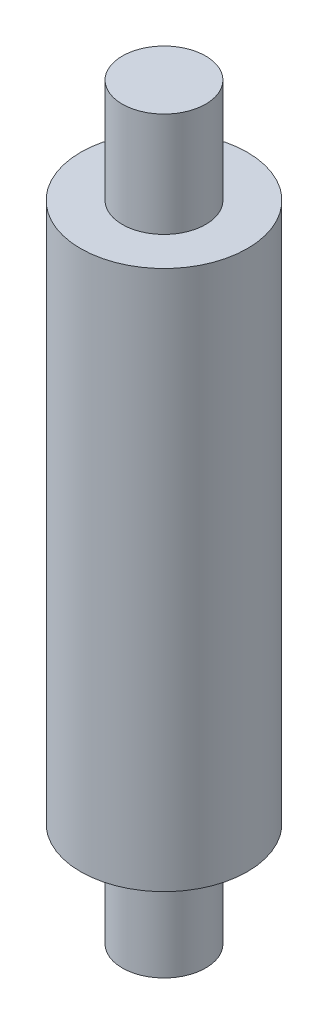
ISO-10303-21;
HEADER;
FILE_DESCRIPTION(('STEP AP214'),'2;1');
FILE_NAME('part.step','',(''),(''),'','','');
FILE_SCHEMA(('AUTOMOTIVE_DESIGN { 1 0 10303 214 1 1 1 1 }'));
ENDSEC;
DATA;
#1=APPLICATION_CONTEXT('core data for automotive mechanical design processes');
#2=APPLICATION_PROTOCOL_DEFINITION('international standard','automotive_design',2000,#1);
#3=PRODUCT_CONTEXT('',#1,'mechanical');
#4=PRODUCT('Part','Part','',(#3));
#5=PRODUCT_RELATED_PRODUCT_CATEGORY('part','',(#4));
#6=PRODUCT_DEFINITION_FORMATION('','',#4);
#7=PRODUCT_DEFINITION_CONTEXT('part definition',#1,'design');
#8=PRODUCT_DEFINITION('design','',#6,#7);
#9=PRODUCT_DEFINITION_SHAPE('','',#8);
#10=(LENGTH_UNIT() NAMED_UNIT(*) SI_UNIT(.MILLI.,.METRE.));
#11=(NAMED_UNIT(*) PLANE_ANGLE_UNIT() SI_UNIT($,.RADIAN.));
#12=(NAMED_UNIT(*) SI_UNIT($,.STERADIAN.) SOLID_ANGLE_UNIT());
#13=UNCERTAINTY_MEASURE_WITH_UNIT(LENGTH_MEASURE(1.E-05),#10,'distance_accuracy_value','');
#14=(GEOMETRIC_REPRESENTATION_CONTEXT(3) GLOBAL_UNCERTAINTY_ASSIGNED_CONTEXT((#13)) GLOBAL_UNIT_ASSIGNED_CONTEXT((#10,
#11,#12)) REPRESENTATION_CONTEXT('',''));
#15=CARTESIAN_POINT('',(0.,0.,0.));
#16=DIRECTION('',(0.,0.,1.));
#17=DIRECTION('',(1.,0.,0.));
#18=AXIS2_PLACEMENT_3D('',#15,#16,#17);
#19=CARTESIAN_POINT('',(0.,0.,0.));
#20=DIRECTION('',(0.,1.,0.));
#21=DIRECTION('',(0.,0.,1.));
#22=AXIS2_PLACEMENT_3D('',#19,#20,#21);
#23=CYLINDRICAL_SURFACE('',#22,3.4544);
#24=CARTESIAN_POINT('',(0.,4.318,0.));
#25=DIRECTION('',(0.,1.,0.));
#26=DIRECTION('',(0.,0.,1.));
#27=AXIS2_PLACEMENT_3D('',#24,#25,#26);
#28=CIRCLE('',#27,3.4544);
#29=CARTESIAN_POINT('',(0.,4.318,3.4544));
#30=VERTEX_POINT('',#29);
#31=EDGE_CURVE('E39',#30,#30,#28,.T.);
#32=ORIENTED_EDGE('',*,*,#31,.T.);
#33=EDGE_LOOP('',(#32));
#34=FACE_BOUND('',#33,.T.);
#35=CARTESIAN_POINT('',(0.,26.67,0.));
#36=DIRECTION('',(0.,1.,0.));
#37=DIRECTION('',(0.,0.,1.));
#38=AXIS2_PLACEMENT_3D('',#35,#36,#37);
#39=CIRCLE('',#38,3.4544);
#40=CARTESIAN_POINT('',(0.,26.67,3.4544));
#41=VERTEX_POINT('',#40);
#42=EDGE_CURVE('E55',#41,#41,#39,.T.);
#43=ORIENTED_EDGE('',*,*,#42,.F.);
#44=EDGE_LOOP('',(#43));
#45=FACE_BOUND('',#44,.T.);
#46=ADVANCED_FACE('F32',(#34,#45),#23,.T.);
#47=CARTESIAN_POINT('',(0.,0.,0.));
#48=DIRECTION('',(0.,1.,0.));
#49=DIRECTION('',(0.,0.,1.));
#50=AXIS2_PLACEMENT_3D('',#47,#48,#49);
#51=CYLINDRICAL_SURFACE('',#50,1.7272);
#52=CARTESIAN_POINT('',(0.,0.,0.));
#53=DIRECTION('',(0.,1.,0.));
#54=DIRECTION('',(0.,0.,1.));
#55=AXIS2_PLACEMENT_3D('',#52,#53,#54);
#56=CIRCLE('',#55,1.7272);
#57=CARTESIAN_POINT('',(0.,0.,1.7272));
#58=VERTEX_POINT('',#57);
#59=EDGE_CURVE('E10',#58,#58,#56,.T.);
#60=ORIENTED_EDGE('',*,*,#59,.T.);
#61=EDGE_LOOP('',(#60));
#62=FACE_BOUND('',#61,.T.);
#63=CARTESIAN_POINT('',(0.,4.318,0.));
#64=DIRECTION('',(0.,1.,0.));
#65=DIRECTION('',(0.,0.,1.));
#66=AXIS2_PLACEMENT_3D('',#63,#64,#65);
#67=CIRCLE('',#66,1.7272);
#68=CARTESIAN_POINT('',(0.,4.318,1.7272));
#69=VERTEX_POINT('',#68);
#70=EDGE_CURVE('E43',#69,#69,#67,.T.);
#71=ORIENTED_EDGE('',*,*,#70,.F.);
#72=EDGE_LOOP('',(#71));
#73=FACE_BOUND('',#72,.T.);
#74=ADVANCED_FACE('F63',(#62,#73),#51,.T.);
#75=CARTESIAN_POINT('',(3.4544,4.318,0.));
#76=DIRECTION('',(0.,-1.,0.));
#77=DIRECTION('',(0.,0.,-1.));
#78=AXIS2_PLACEMENT_3D('',#75,#76,#77);
#79=PLANE('',#78);
#80=ORIENTED_EDGE('',*,*,#70,.T.);
#81=EDGE_LOOP('',(#80));
#82=FACE_BOUND('',#81,.T.);
#83=ORIENTED_EDGE('',*,*,#31,.F.);
#84=EDGE_LOOP('',(#83));
#85=FACE_BOUND('',#84,.T.);
#86=ADVANCED_FACE('F67',(#82,#85),#79,.T.);
#87=CARTESIAN_POINT('',(3.4544,0.,0.));
#88=DIRECTION('',(0.,1.,0.));
#89=DIRECTION('',(0.,0.,1.));
#90=AXIS2_PLACEMENT_3D('',#87,#88,#89);
#91=PLANE('',#90);
#92=ORIENTED_EDGE('',*,*,#59,.F.);
#93=EDGE_LOOP('',(#92));
#94=FACE_BOUND('',#93,.T.);
#95=ADVANCED_FACE('F70',(#94),#91,.F.);
#96=CARTESIAN_POINT('',(0.,26.67,0.));
#97=DIRECTION('',(0.,1.,0.));
#98=DIRECTION('',(0.,0.,1.));
#99=AXIS2_PLACEMENT_3D('',#96,#97,#98);
#100=CYLINDRICAL_SURFACE('',#99,1.7272);
#101=CARTESIAN_POINT('',(0.,26.67,0.));
#102=DIRECTION('',(0.,1.,0.));
#103=DIRECTION('',(0.,0.,1.));
#104=AXIS2_PLACEMENT_3D('',#101,#102,#103);
#105=CIRCLE('',#104,1.7272);
#106=CARTESIAN_POINT('',(0.,26.67,1.7272));
#107=VERTEX_POINT('',#106);
#108=EDGE_CURVE('E52',#107,#107,#105,.T.);
#109=ORIENTED_EDGE('',*,*,#108,.T.);
#110=EDGE_LOOP('',(#109));
#111=FACE_BOUND('',#110,.T.);
#112=CARTESIAN_POINT('',(0.,30.988,0.));
#113=DIRECTION('',(0.,1.,0.));
#114=DIRECTION('',(0.,0.,1.));
#115=AXIS2_PLACEMENT_3D('',#112,#113,#114);
#116=CIRCLE('',#115,1.7272);
#117=CARTESIAN_POINT('',(0.,30.988,1.7272));
#118=VERTEX_POINT('',#117);
#119=EDGE_CURVE('E47',#118,#118,#116,.T.);
#120=ORIENTED_EDGE('',*,*,#119,.F.);
#121=EDGE_LOOP('',(#120));
#122=FACE_BOUND('',#121,.T.);
#123=ADVANCED_FACE('F72',(#111,#122),#100,.T.);
#124=CARTESIAN_POINT('',(1.7272,26.67,0.));
#125=DIRECTION('',(0.,1.,0.));
#126=DIRECTION('',(0.,0.,1.));
#127=AXIS2_PLACEMENT_3D('',#124,#125,#126);
#128=PLANE('',#127);
#129=ORIENTED_EDGE('',*,*,#42,.T.);
#130=EDGE_LOOP('',(#129));
#131=FACE_BOUND('',#130,.T.);
#132=ORIENTED_EDGE('',*,*,#108,.F.);
#133=EDGE_LOOP('',(#132));
#134=FACE_BOUND('',#133,.T.);
#135=ADVANCED_FACE('F59',(#131,#134),#128,.T.);
#136=CARTESIAN_POINT('',(0.,30.988,0.));
#137=DIRECTION('',(0.,-1.,0.));
#138=DIRECTION('',(0.,0.,-1.));
#139=AXIS2_PLACEMENT_3D('',#136,#137,#138);
#140=PLANE('',#139);
#141=ORIENTED_EDGE('',*,*,#119,.T.);
#142=EDGE_LOOP('',(#141));
#143=FACE_BOUND('',#142,.T.);
#144=ADVANCED_FACE('F34',(#143),#140,.F.);
#145=CLOSED_SHELL('',(#46,#74,#86,#95,#123,#135,#144));
#146=MANIFOLD_SOLID_BREP('B2',#145);
#147=ADVANCED_BREP_SHAPE_REPRESENTATION('',(#18,#146),#14);
#148=SHAPE_DEFINITION_REPRESENTATION(#9,#147);
ENDSEC;
END-ISO-10303-21;
